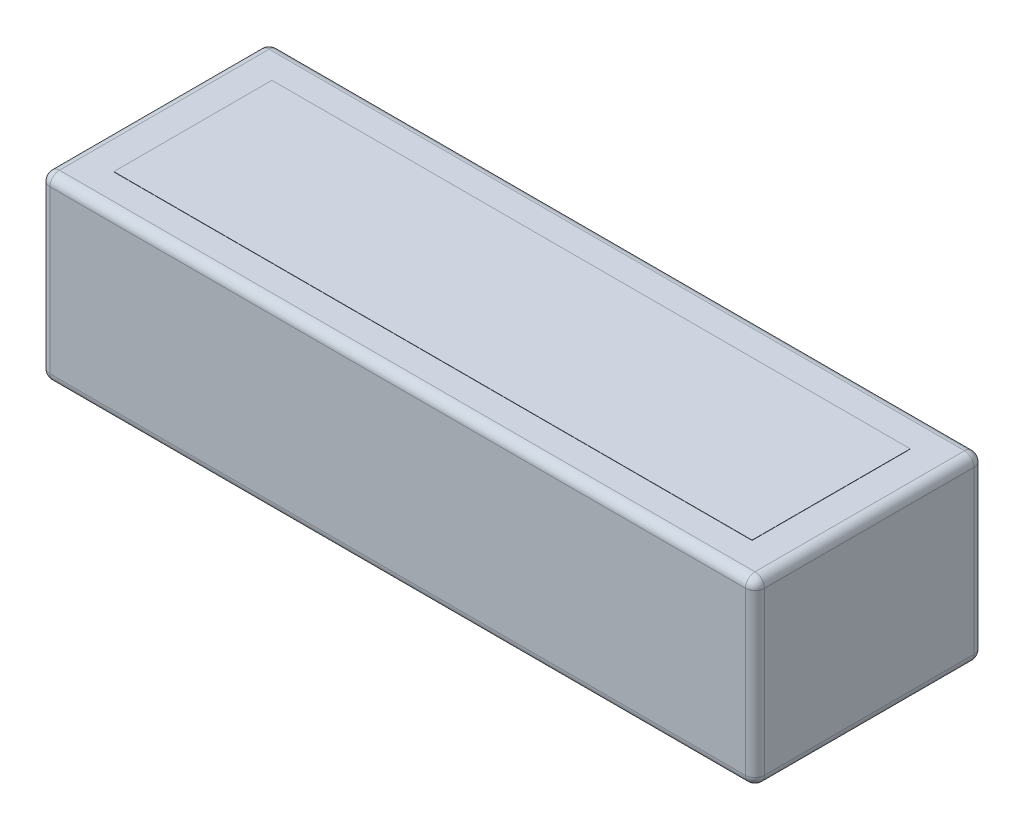
ISO-10303-21;
HEADER;
FILE_DESCRIPTION(('STEP AP214'),'2;1');
FILE_NAME('part.step','',(''),(''),'','','');
FILE_SCHEMA(('AUTOMOTIVE_DESIGN { 1 0 10303 214 1 1 1 1 }'));
ENDSEC;
DATA;
#1=APPLICATION_CONTEXT('core data for automotive mechanical design processes');
#2=APPLICATION_PROTOCOL_DEFINITION('international standard','automotive_design',2000,#1);
#3=PRODUCT_CONTEXT('',#1,'mechanical');
#4=PRODUCT('Part','Part','',(#3));
#5=PRODUCT_RELATED_PRODUCT_CATEGORY('part','',(#4));
#6=PRODUCT_DEFINITION_FORMATION('','',#4);
#7=PRODUCT_DEFINITION_CONTEXT('part definition',#1,'design');
#8=PRODUCT_DEFINITION('design','',#6,#7);
#9=PRODUCT_DEFINITION_SHAPE('','',#8);
#10=(LENGTH_UNIT() NAMED_UNIT(*) SI_UNIT(.MILLI.,.METRE.));
#11=(NAMED_UNIT(*) PLANE_ANGLE_UNIT() SI_UNIT($,.RADIAN.));
#12=(NAMED_UNIT(*) SI_UNIT($,.STERADIAN.) SOLID_ANGLE_UNIT());
#13=UNCERTAINTY_MEASURE_WITH_UNIT(LENGTH_MEASURE(1.E-05),#10,'distance_accuracy_value','');
#14=(GEOMETRIC_REPRESENTATION_CONTEXT(3) GLOBAL_UNCERTAINTY_ASSIGNED_CONTEXT((#13)) GLOBAL_UNIT_ASSIGNED_CONTEXT((#10,
#11,#12)) REPRESENTATION_CONTEXT('',''));
#15=CARTESIAN_POINT('',(0.,0.,0.));
#16=DIRECTION('',(0.,0.,1.));
#17=DIRECTION('',(1.,0.,0.));
#18=AXIS2_PLACEMENT_3D('',#15,#16,#17);
#19=CARTESIAN_POINT('',(0.,38.,0.));
#20=DIRECTION('',(0.,1.,0.));
#21=DIRECTION('',(0.,0.,1.));
#22=AXIS2_PLACEMENT_3D('',#19,#20,#21);
#23=PLANE('',#22);
#24=DIRECTION('',(1.,0.,0.));
#25=VECTOR('',#24,1.);
#26=CARTESIAN_POINT('',(73.,38.,22.));
#27=LINE('',#26,#25);
#28=CARTESIAN_POINT('',(-73.,38.,22.));
#29=VERTEX_POINT('',#28);
#30=CARTESIAN_POINT('',(73.,38.,22.));
#31=VERTEX_POINT('',#30);
#32=EDGE_CURVE('E243',#29,#31,#27,.T.);
#33=ORIENTED_EDGE('',*,*,#32,.T.);
#34=DIRECTION('',(0.,0.,-1.));
#35=VECTOR('',#34,1.);
#36=CARTESIAN_POINT('',(73.,38.,-22.));
#37=LINE('',#36,#35);
#38=CARTESIAN_POINT('',(73.,38.,-22.));
#39=VERTEX_POINT('',#38);
#40=EDGE_CURVE('E59',#31,#39,#37,.T.);
#41=ORIENTED_EDGE('',*,*,#40,.T.);
#42=DIRECTION('',(-1.,0.,0.));
#43=VECTOR('',#42,1.);
#44=CARTESIAN_POINT('',(-73.,38.,-22.));
#45=LINE('',#44,#43);
#46=CARTESIAN_POINT('',(-73.,38.,-22.));
#47=VERTEX_POINT('',#46);
#48=EDGE_CURVE('E245',#39,#47,#45,.T.);
#49=ORIENTED_EDGE('',*,*,#48,.T.);
#50=DIRECTION('',(0.,0.,1.));
#51=VECTOR('',#50,1.);
#52=CARTESIAN_POINT('',(-73.,38.,22.));
#53=LINE('',#52,#51);
#54=EDGE_CURVE('E241',#47,#29,#53,.T.);
#55=ORIENTED_EDGE('',*,*,#54,.T.);
#56=EDGE_LOOP('',(#33,#41,#49,#55));
#57=FACE_BOUND('',#56,.T.);
#58=DIRECTION('',(-1.,0.,0.));
#59=VECTOR('',#58,1.);
#60=CARTESIAN_POINT('',(-66.9958249658965,38.,-16.5987413872904));
#61=LINE('',#60,#59);
#62=CARTESIAN_POINT('',(66.9958249658965,38.,-16.5987413872904));
#63=VERTEX_POINT('',#62);
#64=CARTESIAN_POINT('',(-66.9958249658965,38.,-16.5987413872904));
#65=VERTEX_POINT('',#64);
#66=EDGE_CURVE('E561',#63,#65,#61,.T.);
#67=ORIENTED_EDGE('',*,*,#66,.F.);
#68=DIRECTION('',(0.,0.,-1.));
#69=VECTOR('',#68,1.);
#70=CARTESIAN_POINT('',(66.9958249658965,38.,-16.5987413872904));
#71=LINE('',#70,#69);
#72=CARTESIAN_POINT('',(66.9958249658965,38.,16.5987413872904));
#73=VERTEX_POINT('',#72);
#74=EDGE_CURVE('E172',#73,#63,#71,.T.);
#75=ORIENTED_EDGE('',*,*,#74,.F.);
#76=DIRECTION('',(1.,0.,0.));
#77=VECTOR('',#76,1.);
#78=CARTESIAN_POINT('',(-66.9958249658965,38.,16.5987413872904));
#79=LINE('',#78,#77);
#80=CARTESIAN_POINT('',(-66.9958249658965,38.,16.5987413872904));
#81=VERTEX_POINT('',#80);
#82=EDGE_CURVE('E168',#81,#73,#79,.T.);
#83=ORIENTED_EDGE('',*,*,#82,.F.);
#84=DIRECTION('',(0.,0.,1.));
#85=VECTOR('',#84,1.);
#86=CARTESIAN_POINT('',(-66.9958249658965,38.,-16.5987413872904));
#87=LINE('',#86,#85);
#88=EDGE_CURVE('E558',#65,#81,#87,.T.);
#89=ORIENTED_EDGE('',*,*,#88,.F.);
#90=EDGE_LOOP('',(#67,#75,#83,#89));
#91=FACE_BOUND('',#90,.T.);
#92=ADVANCED_FACE('F34',(#57,#91),#23,.T.);
#93=CARTESIAN_POINT('',(75.,38.,-24.));
#94=DIRECTION('',(-1.,0.,0.));
#95=DIRECTION('',(0.,0.,1.));
#96=AXIS2_PLACEMENT_3D('',#93,#94,#95);
#97=PLANE('',#96);
#98=DIRECTION('',(0.,-1.,0.));
#99=VECTOR('',#98,1.);
#100=CARTESIAN_POINT('',(75.,38.,-22.));
#101=LINE('',#100,#99);
#102=CARTESIAN_POINT('',(75.,2.,-22.));
#103=VERTEX_POINT('',#102);
#104=CARTESIAN_POINT('',(75.,36.,-22.));
#105=VERTEX_POINT('',#104);
#106=EDGE_CURVE('E191',#103,#105,#101,.F.);
#107=ORIENTED_EDGE('',*,*,#106,.T.);
#108=DIRECTION('',(0.,0.,-1.));
#109=VECTOR('',#108,1.);
#110=CARTESIAN_POINT('',(75.,36.,22.));
#111=LINE('',#110,#109);
#112=CARTESIAN_POINT('',(75.,36.,22.));
#113=VERTEX_POINT('',#112);
#114=EDGE_CURVE('E250',#105,#113,#111,.F.);
#115=ORIENTED_EDGE('',*,*,#114,.T.);
#116=DIRECTION('',(0.,-1.,0.));
#117=VECTOR('',#116,1.);
#118=CARTESIAN_POINT('',(75.,38.,22.));
#119=LINE('',#118,#117);
#120=CARTESIAN_POINT('',(75.,2.,22.));
#121=VERTEX_POINT('',#120);
#122=EDGE_CURVE('E188',#113,#121,#119,.T.);
#123=ORIENTED_EDGE('',*,*,#122,.T.);
#124=DIRECTION('',(0.,0.,-1.));
#125=VECTOR('',#124,1.);
#126=CARTESIAN_POINT('',(75.,2.,-24.));
#127=LINE('',#126,#125);
#128=EDGE_CURVE('E248',#121,#103,#127,.T.);
#129=ORIENTED_EDGE('',*,*,#128,.T.);
#130=EDGE_LOOP('',(#107,#115,#123,#129));
#131=FACE_BOUND('',#130,.T.);
#132=ADVANCED_FACE('F342',(#131),#97,.F.);
#133=CARTESIAN_POINT('',(-75.,38.,-24.));
#134=DIRECTION('',(0.,0.,1.));
#135=DIRECTION('',(1.,0.,0.));
#136=AXIS2_PLACEMENT_3D('',#133,#134,#135);
#137=PLANE('',#136);
#138=DIRECTION('',(0.,-1.,0.));
#139=VECTOR('',#138,1.);
#140=CARTESIAN_POINT('',(73.,38.,-24.));
#141=LINE('',#140,#139);
#142=CARTESIAN_POINT('',(73.,36.,-24.));
#143=VERTEX_POINT('',#142);
#144=CARTESIAN_POINT('',(73.,2.,-24.));
#145=VERTEX_POINT('',#144);
#146=EDGE_CURVE('E184',#143,#145,#141,.T.);
#147=ORIENTED_EDGE('',*,*,#146,.T.);
#148=DIRECTION('',(-1.,0.,0.));
#149=VECTOR('',#148,1.);
#150=CARTESIAN_POINT('',(-75.,2.,-24.));
#151=LINE('',#150,#149);
#152=CARTESIAN_POINT('',(-73.,2.,-24.));
#153=VERTEX_POINT('',#152);
#154=EDGE_CURVE('E214',#145,#153,#151,.T.);
#155=ORIENTED_EDGE('',*,*,#154,.T.);
#156=DIRECTION('',(0.,-1.,0.));
#157=VECTOR('',#156,1.);
#158=CARTESIAN_POINT('',(-73.,38.,-24.));
#159=LINE('',#158,#157);
#160=CARTESIAN_POINT('',(-73.,36.,-24.));
#161=VERTEX_POINT('',#160);
#162=EDGE_CURVE('E181',#153,#161,#159,.F.);
#163=ORIENTED_EDGE('',*,*,#162,.T.);
#164=DIRECTION('',(-1.,0.,0.));
#165=VECTOR('',#164,1.);
#166=CARTESIAN_POINT('',(73.,36.,-24.));
#167=LINE('',#166,#165);
#168=EDGE_CURVE('E212',#161,#143,#167,.F.);
#169=ORIENTED_EDGE('',*,*,#168,.T.);
#170=EDGE_LOOP('',(#147,#155,#163,#169));
#171=FACE_BOUND('',#170,.T.);
#172=ADVANCED_FACE('F393',(#171),#137,.F.);
#173=CARTESIAN_POINT('',(-75.,38.,-24.));
#174=DIRECTION('',(1.,0.,0.));
#175=DIRECTION('',(0.,0.,-1.));
#176=AXIS2_PLACEMENT_3D('',#173,#174,#175);
#177=PLANE('',#176);
#178=DIRECTION('',(0.,-1.,0.));
#179=VECTOR('',#178,1.);
#180=CARTESIAN_POINT('',(-75.,38.,-22.));
#181=LINE('',#180,#179);
#182=CARTESIAN_POINT('',(-75.,36.,-22.));
#183=VERTEX_POINT('',#182);
#184=CARTESIAN_POINT('',(-75.,2.,-22.));
#185=VERTEX_POINT('',#184);
#186=EDGE_CURVE('E203',#183,#185,#181,.T.);
#187=ORIENTED_EDGE('',*,*,#186,.T.);
#188=DIRECTION('',(0.,0.,1.));
#189=VECTOR('',#188,1.);
#190=CARTESIAN_POINT('',(-75.,2.,-24.));
#191=LINE('',#190,#189);
#192=CARTESIAN_POINT('',(-75.,2.,22.));
#193=VERTEX_POINT('',#192);
#194=EDGE_CURVE('E11',#185,#193,#191,.T.);
#195=ORIENTED_EDGE('',*,*,#194,.T.);
#196=DIRECTION('',(0.,-1.,0.));
#197=VECTOR('',#196,1.);
#198=CARTESIAN_POINT('',(-75.,38.,22.));
#199=LINE('',#198,#197);
#200=CARTESIAN_POINT('',(-75.,36.,22.));
#201=VERTEX_POINT('',#200);
#202=EDGE_CURVE('E200',#193,#201,#199,.F.);
#203=ORIENTED_EDGE('',*,*,#202,.T.);
#204=DIRECTION('',(0.,0.,1.));
#205=VECTOR('',#204,1.);
#206=CARTESIAN_POINT('',(-75.,36.,-22.));
#207=LINE('',#206,#205);
#208=EDGE_CURVE('E43',#201,#183,#207,.F.);
#209=ORIENTED_EDGE('',*,*,#208,.T.);
#210=EDGE_LOOP('',(#187,#195,#203,#209));
#211=FACE_BOUND('',#210,.T.);
#212=ADVANCED_FACE('F370',(#211),#177,.F.);
#213=CARTESIAN_POINT('',(-75.,38.,24.));
#214=DIRECTION('',(0.,0.,-1.));
#215=DIRECTION('',(-1.,0.,0.));
#216=AXIS2_PLACEMENT_3D('',#213,#214,#215);
#217=PLANE('',#216);
#218=DIRECTION('',(0.,-1.,0.));
#219=VECTOR('',#218,1.);
#220=CARTESIAN_POINT('',(-73.,38.,24.));
#221=LINE('',#220,#219);
#222=CARTESIAN_POINT('',(-73.,36.,24.));
#223=VERTEX_POINT('',#222);
#224=CARTESIAN_POINT('',(-73.,2.,24.));
#225=VERTEX_POINT('',#224);
#226=EDGE_CURVE('E194',#223,#225,#221,.T.);
#227=ORIENTED_EDGE('',*,*,#226,.T.);
#228=DIRECTION('',(1.,0.,0.));
#229=VECTOR('',#228,1.);
#230=CARTESIAN_POINT('',(-75.,2.,24.));
#231=LINE('',#230,#229);
#232=CARTESIAN_POINT('',(73.,2.,24.));
#233=VERTEX_POINT('',#232);
#234=EDGE_CURVE('E235',#225,#233,#231,.T.);
#235=ORIENTED_EDGE('',*,*,#234,.T.);
#236=DIRECTION('',(0.,-1.,0.));
#237=VECTOR('',#236,1.);
#238=CARTESIAN_POINT('',(73.,38.,24.));
#239=LINE('',#238,#237);
#240=CARTESIAN_POINT('',(73.,36.,24.));
#241=VERTEX_POINT('',#240);
#242=EDGE_CURVE('E197',#233,#241,#239,.F.);
#243=ORIENTED_EDGE('',*,*,#242,.T.);
#244=DIRECTION('',(1.,0.,0.));
#245=VECTOR('',#244,1.);
#246=CARTESIAN_POINT('',(-73.,36.,24.));
#247=LINE('',#246,#245);
#248=EDGE_CURVE('E233',#241,#223,#247,.F.);
#249=ORIENTED_EDGE('',*,*,#248,.T.);
#250=EDGE_LOOP('',(#227,#235,#243,#249));
#251=FACE_BOUND('',#250,.T.);
#252=ADVANCED_FACE('F305',(#251),#217,.F.);
#253=CARTESIAN_POINT('',(0.,0.,0.));
#254=DIRECTION('',(0.,1.,0.));
#255=DIRECTION('',(0.,0.,1.));
#256=AXIS2_PLACEMENT_3D('',#253,#254,#255);
#257=PLANE('',#256);
#258=DIRECTION('',(-1.,0.,0.));
#259=VECTOR('',#258,1.);
#260=CARTESIAN_POINT('',(0.,0.,-22.));
#261=LINE('',#260,#259);
#262=CARTESIAN_POINT('',(-73.,0.,-22.));
#263=VERTEX_POINT('',#262);
#264=CARTESIAN_POINT('',(73.,0.,-22.));
#265=VERTEX_POINT('',#264);
#266=EDGE_CURVE('E220',#263,#265,#261,.F.);
#267=ORIENTED_EDGE('',*,*,#266,.T.);
#268=DIRECTION('',(0.,0.,-1.));
#269=VECTOR('',#268,1.);
#270=CARTESIAN_POINT('',(73.,0.,0.));
#271=LINE('',#270,#269);
#272=CARTESIAN_POINT('',(73.,0.,22.));
#273=VERTEX_POINT('',#272);
#274=EDGE_CURVE('E223',#265,#273,#271,.F.);
#275=ORIENTED_EDGE('',*,*,#274,.T.);
#276=DIRECTION('',(1.,0.,0.));
#277=VECTOR('',#276,1.);
#278=CARTESIAN_POINT('',(0.,0.,22.));
#279=LINE('',#278,#277);
#280=CARTESIAN_POINT('',(-73.,0.,22.));
#281=VERTEX_POINT('',#280);
#282=EDGE_CURVE('E218',#273,#281,#279,.F.);
#283=ORIENTED_EDGE('',*,*,#282,.T.);
#284=DIRECTION('',(0.,0.,1.));
#285=VECTOR('',#284,1.);
#286=CARTESIAN_POINT('',(-73.,0.,0.));
#287=LINE('',#286,#285);
#288=EDGE_CURVE('E216',#281,#263,#287,.F.);
#289=ORIENTED_EDGE('',*,*,#288,.T.);
#290=EDGE_LOOP('',(#267,#275,#283,#289));
#291=FACE_BOUND('',#290,.T.);
#292=ADVANCED_FACE('F324',(#291),#257,.F.);
#293=CARTESIAN_POINT('',(73.,38.,-22.));
#294=DIRECTION('',(0.,-1.,0.));
#295=DIRECTION('',(0.,0.,-1.));
#296=AXIS2_PLACEMENT_3D('',#293,#294,#295);
#297=CYLINDRICAL_SURFACE('',#296,2.);
#298=ORIENTED_EDGE('',*,*,#106,.F.);
#299=CARTESIAN_POINT('',(73.,2.,-22.));
#300=DIRECTION('',(0.,-1.,0.));
#301=DIRECTION('',(0.,0.,-1.));
#302=AXIS2_PLACEMENT_3D('',#299,#300,#301);
#303=CIRCLE('',#302,2.);
#304=EDGE_CURVE('E227',#103,#145,#303,.F.);
#305=ORIENTED_EDGE('',*,*,#304,.T.);
#306=ORIENTED_EDGE('',*,*,#146,.F.);
#307=CARTESIAN_POINT('',(73.,36.,-22.));
#308=DIRECTION('',(0.,-1.,0.));
#309=DIRECTION('',(0.,0.,-1.));
#310=AXIS2_PLACEMENT_3D('',#307,#308,#309);
#311=CIRCLE('',#310,2.);
#312=EDGE_CURVE('E225',#143,#105,#311,.T.);
#313=ORIENTED_EDGE('',*,*,#312,.T.);
#314=EDGE_LOOP('',(#298,#305,#306,#313));
#315=FACE_BOUND('',#314,.T.);
#316=ADVANCED_FACE('F345',(#315),#297,.T.);
#317=CARTESIAN_POINT('',(73.,38.,22.));
#318=DIRECTION('',(0.,-1.,0.));
#319=DIRECTION('',(0.,0.,-1.));
#320=AXIS2_PLACEMENT_3D('',#317,#318,#319);
#321=CYLINDRICAL_SURFACE('',#320,2.);
#322=ORIENTED_EDGE('',*,*,#242,.F.);
#323=CARTESIAN_POINT('',(73.,2.,22.));
#324=DIRECTION('',(0.,-1.,0.));
#325=DIRECTION('',(0.,0.,-1.));
#326=AXIS2_PLACEMENT_3D('',#323,#324,#325);
#327=CIRCLE('',#326,2.);
#328=EDGE_CURVE('E231',#233,#121,#327,.F.);
#329=ORIENTED_EDGE('',*,*,#328,.T.);
#330=ORIENTED_EDGE('',*,*,#122,.F.);
#331=CARTESIAN_POINT('',(73.,36.,22.));
#332=DIRECTION('',(0.,-1.,0.));
#333=DIRECTION('',(0.,0.,-1.));
#334=AXIS2_PLACEMENT_3D('',#331,#332,#333);
#335=CIRCLE('',#334,2.);
#336=EDGE_CURVE('E229',#113,#241,#335,.T.);
#337=ORIENTED_EDGE('',*,*,#336,.T.);
#338=EDGE_LOOP('',(#322,#329,#330,#337));
#339=FACE_BOUND('',#338,.T.);
#340=ADVANCED_FACE('F302',(#339),#321,.T.);
#341=CARTESIAN_POINT('',(-73.,38.,-22.));
#342=DIRECTION('',(0.,-1.,0.));
#343=DIRECTION('',(0.,0.,-1.));
#344=AXIS2_PLACEMENT_3D('',#341,#342,#343);
#345=CYLINDRICAL_SURFACE('',#344,2.);
#346=ORIENTED_EDGE('',*,*,#162,.F.);
#347=CARTESIAN_POINT('',(-73.,2.,-22.));
#348=DIRECTION('',(0.,-1.,0.));
#349=DIRECTION('',(0.,0.,-1.));
#350=AXIS2_PLACEMENT_3D('',#347,#348,#349);
#351=CIRCLE('',#350,2.);
#352=EDGE_CURVE('E209',#153,#185,#351,.F.);
#353=ORIENTED_EDGE('',*,*,#352,.T.);
#354=ORIENTED_EDGE('',*,*,#186,.F.);
#355=CARTESIAN_POINT('',(-73.,36.,-22.));
#356=DIRECTION('',(0.,-1.,0.));
#357=DIRECTION('',(0.,0.,-1.));
#358=AXIS2_PLACEMENT_3D('',#355,#356,#357);
#359=CIRCLE('',#358,2.);
#360=EDGE_CURVE('E206',#183,#161,#359,.T.);
#361=ORIENTED_EDGE('',*,*,#360,.T.);
#362=EDGE_LOOP('',(#346,#353,#354,#361));
#363=FACE_BOUND('',#362,.T.);
#364=ADVANCED_FACE('F375',(#363),#345,.T.);
#365=CARTESIAN_POINT('',(-73.,38.,22.));
#366=DIRECTION('',(0.,-1.,0.));
#367=DIRECTION('',(0.,0.,-1.));
#368=AXIS2_PLACEMENT_3D('',#365,#366,#367);
#369=CYLINDRICAL_SURFACE('',#368,2.);
#370=ORIENTED_EDGE('',*,*,#202,.F.);
#371=CARTESIAN_POINT('',(-73.,2.,22.));
#372=DIRECTION('',(0.,-1.,0.));
#373=DIRECTION('',(0.,0.,-1.));
#374=AXIS2_PLACEMENT_3D('',#371,#372,#373);
#375=CIRCLE('',#374,2.);
#376=EDGE_CURVE('E239',#193,#225,#375,.F.);
#377=ORIENTED_EDGE('',*,*,#376,.T.);
#378=ORIENTED_EDGE('',*,*,#226,.F.);
#379=CARTESIAN_POINT('',(-73.,36.,22.));
#380=DIRECTION('',(0.,-1.,0.));
#381=DIRECTION('',(0.,0.,-1.));
#382=AXIS2_PLACEMENT_3D('',#379,#380,#381);
#383=CIRCLE('',#382,2.);
#384=EDGE_CURVE('E237',#223,#201,#383,.T.);
#385=ORIENTED_EDGE('',*,*,#384,.T.);
#386=EDGE_LOOP('',(#370,#377,#378,#385));
#387=FACE_BOUND('',#386,.T.);
#388=ADVANCED_FACE('F412',(#387),#369,.T.);
#389=CARTESIAN_POINT('',(73.,2.,22.));
#390=DIRECTION('',(0.,1.,0.));
#391=DIRECTION('',(0.,0.,1.));
#392=AXIS2_PLACEMENT_3D('',#389,#390,#391);
#393=SPHERICAL_SURFACE('',#392,2.);
#394=CARTESIAN_POINT('',(73.,2.,22.));
#395=DIRECTION('',(0.,0.,-1.));
#396=DIRECTION('',(-1.,0.,0.));
#397=AXIS2_PLACEMENT_3D('',#394,#395,#396);
#398=CIRCLE('',#397,2.);
#399=EDGE_CURVE('E269',#121,#273,#398,.T.);
#400=ORIENTED_EDGE('',*,*,#399,.F.);
#401=ORIENTED_EDGE('',*,*,#328,.F.);
#402=CARTESIAN_POINT('',(73.,2.,22.));
#403=DIRECTION('',(-1.,0.,0.));
#404=DIRECTION('',(0.,0.,1.));
#405=AXIS2_PLACEMENT_3D('',#402,#403,#404);
#406=CIRCLE('',#405,2.);
#407=EDGE_CURVE('E185',#273,#233,#406,.T.);
#408=ORIENTED_EDGE('',*,*,#407,.F.);
#409=EDGE_LOOP('',(#400,#401,#408));
#410=FACE_BOUND('',#409,.T.);
#411=ADVANCED_FACE('F340',(#410),#393,.T.);
#412=CARTESIAN_POINT('',(-75.,2.,22.));
#413=DIRECTION('',(1.,0.,0.));
#414=DIRECTION('',(0.,0.,-1.));
#415=AXIS2_PLACEMENT_3D('',#412,#413,#414);
#416=CYLINDRICAL_SURFACE('',#415,2.);
#417=ORIENTED_EDGE('',*,*,#407,.T.);
#418=ORIENTED_EDGE('',*,*,#234,.F.);
#419=CARTESIAN_POINT('',(-73.,2.,22.));
#420=DIRECTION('',(-1.,0.,0.));
#421=DIRECTION('',(0.,0.,1.));
#422=AXIS2_PLACEMENT_3D('',#419,#420,#421);
#423=CIRCLE('',#422,2.);
#424=EDGE_CURVE('E266',#281,#225,#423,.T.);
#425=ORIENTED_EDGE('',*,*,#424,.F.);
#426=ORIENTED_EDGE('',*,*,#282,.F.);
#427=EDGE_LOOP('',(#417,#418,#425,#426));
#428=FACE_BOUND('',#427,.T.);
#429=ADVANCED_FACE('F310',(#428),#416,.T.);
#430=CARTESIAN_POINT('',(73.,2.,-24.));
#431=DIRECTION('',(0.,0.,-1.));
#432=DIRECTION('',(-1.,0.,0.));
#433=AXIS2_PLACEMENT_3D('',#430,#431,#432);
#434=CYLINDRICAL_SURFACE('',#433,2.);
#435=ORIENTED_EDGE('',*,*,#399,.T.);
#436=ORIENTED_EDGE('',*,*,#274,.F.);
#437=CARTESIAN_POINT('',(73.,2.,-22.));
#438=DIRECTION('',(0.,0.,-1.));
#439=DIRECTION('',(-1.,0.,0.));
#440=AXIS2_PLACEMENT_3D('',#437,#438,#439);
#441=CIRCLE('',#440,2.);
#442=EDGE_CURVE('E263',#103,#265,#441,.T.);
#443=ORIENTED_EDGE('',*,*,#442,.F.);
#444=ORIENTED_EDGE('',*,*,#128,.F.);
#445=EDGE_LOOP('',(#435,#436,#443,#444));
#446=FACE_BOUND('',#445,.T.);
#447=ADVANCED_FACE('F337',(#446),#434,.T.);
#448=CARTESIAN_POINT('',(-73.,2.,22.));
#449=DIRECTION('',(0.,1.,0.));
#450=DIRECTION('',(0.,0.,1.));
#451=AXIS2_PLACEMENT_3D('',#448,#449,#450);
#452=SPHERICAL_SURFACE('',#451,2.);
#453=ORIENTED_EDGE('',*,*,#424,.T.);
#454=ORIENTED_EDGE('',*,*,#376,.F.);
#455=CARTESIAN_POINT('',(-73.,2.,22.));
#456=DIRECTION('',(0.,0.,-1.));
#457=DIRECTION('',(-1.,0.,0.));
#458=AXIS2_PLACEMENT_3D('',#455,#456,#457);
#459=CIRCLE('',#458,2.);
#460=EDGE_CURVE('E260',#281,#193,#459,.T.);
#461=ORIENTED_EDGE('',*,*,#460,.F.);
#462=EDGE_LOOP('',(#453,#454,#461));
#463=FACE_BOUND('',#462,.T.);
#464=ADVANCED_FACE('F316',(#463),#452,.T.);
#465=CARTESIAN_POINT('',(73.,2.,-22.));
#466=DIRECTION('',(0.,1.,0.));
#467=DIRECTION('',(0.,0.,1.));
#468=AXIS2_PLACEMENT_3D('',#465,#466,#467);
#469=SPHERICAL_SURFACE('',#468,2.);
#470=ORIENTED_EDGE('',*,*,#304,.F.);
#471=ORIENTED_EDGE('',*,*,#442,.T.);
#472=CARTESIAN_POINT('',(73.,2.,-22.));
#473=DIRECTION('',(-1.,0.,0.));
#474=DIRECTION('',(0.,0.,1.));
#475=AXIS2_PLACEMENT_3D('',#472,#473,#474);
#476=CIRCLE('',#475,2.);
#477=EDGE_CURVE('E258',#145,#265,#476,.T.);
#478=ORIENTED_EDGE('',*,*,#477,.F.);
#479=EDGE_LOOP('',(#470,#471,#478));
#480=FACE_BOUND('',#479,.T.);
#481=ADVANCED_FACE('F334',(#480),#469,.T.);
#482=CARTESIAN_POINT('',(-73.,2.,-24.));
#483=DIRECTION('',(0.,0.,1.));
#484=DIRECTION('',(1.,0.,0.));
#485=AXIS2_PLACEMENT_3D('',#482,#483,#484);
#486=CYLINDRICAL_SURFACE('',#485,2.);
#487=ORIENTED_EDGE('',*,*,#460,.T.);
#488=ORIENTED_EDGE('',*,*,#194,.F.);
#489=CARTESIAN_POINT('',(-73.,2.,-22.));
#490=DIRECTION('',(0.,0.,-1.));
#491=DIRECTION('',(-1.,0.,0.));
#492=AXIS2_PLACEMENT_3D('',#489,#490,#491);
#493=CIRCLE('',#492,2.);
#494=EDGE_CURVE('E256',#263,#185,#493,.T.);
#495=ORIENTED_EDGE('',*,*,#494,.F.);
#496=ORIENTED_EDGE('',*,*,#288,.F.);
#497=EDGE_LOOP('',(#487,#488,#495,#496));
#498=FACE_BOUND('',#497,.T.);
#499=ADVANCED_FACE('F321',(#498),#486,.T.);
#500=CARTESIAN_POINT('',(-75.,2.,-22.));
#501=DIRECTION('',(-1.,0.,0.));
#502=DIRECTION('',(0.,0.,1.));
#503=AXIS2_PLACEMENT_3D('',#500,#501,#502);
#504=CYLINDRICAL_SURFACE('',#503,2.);
#505=ORIENTED_EDGE('',*,*,#477,.T.);
#506=ORIENTED_EDGE('',*,*,#266,.F.);
#507=CARTESIAN_POINT('',(-73.,2.,-22.));
#508=DIRECTION('',(-1.,0.,0.));
#509=DIRECTION('',(0.,0.,1.));
#510=AXIS2_PLACEMENT_3D('',#507,#508,#509);
#511=CIRCLE('',#510,2.);
#512=EDGE_CURVE('E253',#153,#263,#511,.T.);
#513=ORIENTED_EDGE('',*,*,#512,.F.);
#514=ORIENTED_EDGE('',*,*,#154,.F.);
#515=EDGE_LOOP('',(#505,#506,#513,#514));
#516=FACE_BOUND('',#515,.T.);
#517=ADVANCED_FACE('F327',(#516),#504,.T.);
#518=CARTESIAN_POINT('',(-73.,2.,-22.));
#519=DIRECTION('',(0.,1.,0.));
#520=DIRECTION('',(0.,0.,1.));
#521=AXIS2_PLACEMENT_3D('',#518,#519,#520);
#522=SPHERICAL_SURFACE('',#521,2.);
#523=ORIENTED_EDGE('',*,*,#494,.T.);
#524=ORIENTED_EDGE('',*,*,#352,.F.);
#525=ORIENTED_EDGE('',*,*,#512,.T.);
#526=EDGE_LOOP('',(#523,#524,#525));
#527=FACE_BOUND('',#526,.T.);
#528=ADVANCED_FACE('F416',(#527),#522,.T.);
#529=CARTESIAN_POINT('',(73.,36.,22.));
#530=DIRECTION('',(0.,1.,0.));
#531=DIRECTION('',(0.,0.,1.));
#532=AXIS2_PLACEMENT_3D('',#529,#530,#531);
#533=SPHERICAL_SURFACE('',#532,2.);
#534=CARTESIAN_POINT('',(73.,36.,22.));
#535=DIRECTION('',(-1.,0.,0.));
#536=DIRECTION('',(0.,0.,1.));
#537=AXIS2_PLACEMENT_3D('',#534,#535,#536);
#538=CIRCLE('',#537,2.);
#539=EDGE_CURVE('E286',#241,#31,#538,.T.);
#540=ORIENTED_EDGE('',*,*,#539,.F.);
#541=ORIENTED_EDGE('',*,*,#336,.F.);
#542=CARTESIAN_POINT('',(73.,36.,22.));
#543=DIRECTION('',(0.,0.,-1.));
#544=DIRECTION('',(-1.,0.,0.));
#545=AXIS2_PLACEMENT_3D('',#542,#543,#544);
#546=CIRCLE('',#545,2.);
#547=EDGE_CURVE('E38',#31,#113,#546,.T.);
#548=ORIENTED_EDGE('',*,*,#547,.F.);
#549=EDGE_LOOP('',(#540,#541,#548));
#550=FACE_BOUND('',#549,.T.);
#551=ADVANCED_FACE('F36',(#550),#533,.T.);
#552=CARTESIAN_POINT('',(73.,36.,0.));
#553=DIRECTION('',(0.,0.,1.));
#554=DIRECTION('',(1.,0.,0.));
#555=AXIS2_PLACEMENT_3D('',#552,#553,#554);
#556=CYLINDRICAL_SURFACE('',#555,2.);
#557=ORIENTED_EDGE('',*,*,#547,.T.);
#558=ORIENTED_EDGE('',*,*,#114,.F.);
#559=CARTESIAN_POINT('',(73.,36.,-22.));
#560=DIRECTION('',(0.,0.,-1.));
#561=DIRECTION('',(-1.,0.,0.));
#562=AXIS2_PLACEMENT_3D('',#559,#560,#561);
#563=CIRCLE('',#562,2.);
#564=EDGE_CURVE('E284',#39,#105,#563,.T.);
#565=ORIENTED_EDGE('',*,*,#564,.F.);
#566=ORIENTED_EDGE('',*,*,#40,.F.);
#567=EDGE_LOOP('',(#557,#558,#565,#566));
#568=FACE_BOUND('',#567,.T.);
#569=ADVANCED_FACE('F296',(#568),#556,.T.);
#570=CARTESIAN_POINT('',(0.,36.,22.));
#571=DIRECTION('',(-1.,0.,0.));
#572=DIRECTION('',(0.,0.,1.));
#573=AXIS2_PLACEMENT_3D('',#570,#571,#572);
#574=CYLINDRICAL_SURFACE('',#573,2.);
#575=ORIENTED_EDGE('',*,*,#539,.T.);
#576=ORIENTED_EDGE('',*,*,#32,.F.);
#577=CARTESIAN_POINT('',(-73.,36.,22.));
#578=DIRECTION('',(-1.,0.,0.));
#579=DIRECTION('',(0.,0.,1.));
#580=AXIS2_PLACEMENT_3D('',#577,#578,#579);
#581=CIRCLE('',#580,2.);
#582=EDGE_CURVE('E281',#223,#29,#581,.T.);
#583=ORIENTED_EDGE('',*,*,#582,.F.);
#584=ORIENTED_EDGE('',*,*,#248,.F.);
#585=EDGE_LOOP('',(#575,#576,#583,#584));
#586=FACE_BOUND('',#585,.T.);
#587=ADVANCED_FACE('F361',(#586),#574,.T.);
#588=CARTESIAN_POINT('',(73.,36.,-22.));
#589=DIRECTION('',(0.,1.,0.));
#590=DIRECTION('',(0.,0.,1.));
#591=AXIS2_PLACEMENT_3D('',#588,#589,#590);
#592=SPHERICAL_SURFACE('',#591,2.);
#593=ORIENTED_EDGE('',*,*,#564,.T.);
#594=ORIENTED_EDGE('',*,*,#312,.F.);
#595=CARTESIAN_POINT('',(73.,36.,-22.));
#596=DIRECTION('',(-1.,0.,0.));
#597=DIRECTION('',(0.,0.,1.));
#598=AXIS2_PLACEMENT_3D('',#595,#596,#597);
#599=CIRCLE('',#598,2.);
#600=EDGE_CURVE('E278',#39,#143,#599,.T.);
#601=ORIENTED_EDGE('',*,*,#600,.F.);
#602=EDGE_LOOP('',(#593,#594,#601));
#603=FACE_BOUND('',#602,.T.);
#604=ADVANCED_FACE('F350',(#603),#592,.T.);
#605=CARTESIAN_POINT('',(-73.,36.,22.));
#606=DIRECTION('',(0.,1.,0.));
#607=DIRECTION('',(0.,0.,1.));
#608=AXIS2_PLACEMENT_3D('',#605,#606,#607);
#609=SPHERICAL_SURFACE('',#608,2.);
#610=ORIENTED_EDGE('',*,*,#384,.F.);
#611=ORIENTED_EDGE('',*,*,#582,.T.);
#612=CARTESIAN_POINT('',(-73.,36.,22.));
#613=DIRECTION('',(0.,0.,-1.));
#614=DIRECTION('',(-1.,0.,0.));
#615=AXIS2_PLACEMENT_3D('',#612,#613,#614);
#616=CIRCLE('',#615,2.);
#617=EDGE_CURVE('E275',#201,#29,#616,.T.);
#618=ORIENTED_EDGE('',*,*,#617,.F.);
#619=EDGE_LOOP('',(#610,#611,#618));
#620=FACE_BOUND('',#619,.T.);
#621=ADVANCED_FACE('F365',(#620),#609,.T.);
#622=CARTESIAN_POINT('',(0.,36.,-22.));
#623=DIRECTION('',(1.,0.,0.));
#624=DIRECTION('',(0.,0.,-1.));
#625=AXIS2_PLACEMENT_3D('',#622,#623,#624);
#626=CYLINDRICAL_SURFACE('',#625,2.);
#627=ORIENTED_EDGE('',*,*,#600,.T.);
#628=ORIENTED_EDGE('',*,*,#168,.F.);
#629=CARTESIAN_POINT('',(-73.,36.,-22.));
#630=DIRECTION('',(-1.,0.,0.));
#631=DIRECTION('',(0.,0.,1.));
#632=AXIS2_PLACEMENT_3D('',#629,#630,#631);
#633=CIRCLE('',#632,2.);
#634=EDGE_CURVE('E176',#47,#161,#633,.T.);
#635=ORIENTED_EDGE('',*,*,#634,.F.);
#636=ORIENTED_EDGE('',*,*,#48,.F.);
#637=EDGE_LOOP('',(#627,#628,#635,#636));
#638=FACE_BOUND('',#637,.T.);
#639=ADVANCED_FACE('F354',(#638),#626,.T.);
#640=CARTESIAN_POINT('',(-73.,36.,0.));
#641=DIRECTION('',(0.,0.,-1.));
#642=DIRECTION('',(-1.,0.,0.));
#643=AXIS2_PLACEMENT_3D('',#640,#641,#642);
#644=CYLINDRICAL_SURFACE('',#643,2.);
#645=ORIENTED_EDGE('',*,*,#617,.T.);
#646=ORIENTED_EDGE('',*,*,#54,.F.);
#647=CARTESIAN_POINT('',(-73.,36.,-22.));
#648=DIRECTION('',(0.,0.,-1.));
#649=DIRECTION('',(-1.,0.,0.));
#650=AXIS2_PLACEMENT_3D('',#647,#648,#649);
#651=CIRCLE('',#650,2.);
#652=EDGE_CURVE('E174',#183,#47,#651,.T.);
#653=ORIENTED_EDGE('',*,*,#652,.F.);
#654=ORIENTED_EDGE('',*,*,#208,.F.);
#655=EDGE_LOOP('',(#645,#646,#653,#654));
#656=FACE_BOUND('',#655,.T.);
#657=ADVANCED_FACE('F367',(#656),#644,.T.);
#658=CARTESIAN_POINT('',(-73.,36.,-22.));
#659=DIRECTION('',(0.,1.,0.));
#660=DIRECTION('',(0.,0.,1.));
#661=AXIS2_PLACEMENT_3D('',#658,#659,#660);
#662=SPHERICAL_SURFACE('',#661,2.);
#663=ORIENTED_EDGE('',*,*,#634,.T.);
#664=ORIENTED_EDGE('',*,*,#360,.F.);
#665=ORIENTED_EDGE('',*,*,#652,.T.);
#666=EDGE_LOOP('',(#663,#664,#665));
#667=FACE_BOUND('',#666,.T.);
#668=ADVANCED_FACE('F378',(#667),#662,.T.);
#669=CARTESIAN_POINT('',(66.9958249658965,38.05,-16.5987413872904));
#670=DIRECTION('',(-1.,0.,0.));
#671=DIRECTION('',(0.,0.,1.));
#672=AXIS2_PLACEMENT_3D('',#669,#670,#671);
#673=PLANE('',#672);
#674=ORIENTED_EDGE('',*,*,#74,.T.);
#675=DIRECTION('',(0.,-1.,0.));
#676=VECTOR('',#675,1.);
#677=CARTESIAN_POINT('',(66.9958249658965,38.05,-16.5987413872904));
#678=LINE('',#677,#676);
#679=CARTESIAN_POINT('',(66.9958249658965,38.05,-16.5987413872904));
#680=VERTEX_POINT('',#679);
#681=EDGE_CURVE('E153',#680,#63,#678,.T.);
#682=ORIENTED_EDGE('',*,*,#681,.F.);
#683=DIRECTION('',(0.,0.,-1.));
#684=VECTOR('',#683,1.);
#685=CARTESIAN_POINT('',(66.9958249658965,38.05,-16.5987413872904));
#686=LINE('',#685,#684);
#687=CARTESIAN_POINT('',(66.9958249658965,38.05,16.5987413872904));
#688=VERTEX_POINT('',#687);
#689=EDGE_CURVE('E160',#688,#680,#686,.T.);
#690=ORIENTED_EDGE('',*,*,#689,.F.);
#691=DIRECTION('',(0.,-1.,0.));
#692=VECTOR('',#691,1.);
#693=CARTESIAN_POINT('',(66.9958249658965,38.05,16.5987413872904));
#694=LINE('',#693,#692);
#695=EDGE_CURVE('E556',#688,#73,#694,.T.);
#696=ORIENTED_EDGE('',*,*,#695,.T.);
#697=EDGE_LOOP('',(#674,#682,#690,#696));
#698=FACE_BOUND('',#697,.T.);
#699=ADVANCED_FACE('F170',(#698),#673,.F.);
#700=CARTESIAN_POINT('',(-66.9958249658965,38.05,-16.5987413872904));
#701=DIRECTION('',(0.,0.,1.));
#702=DIRECTION('',(1.,0.,0.));
#703=AXIS2_PLACEMENT_3D('',#700,#701,#702);
#704=PLANE('',#703);
#705=ORIENTED_EDGE('',*,*,#66,.T.);
#706=DIRECTION('',(0.,-1.,0.));
#707=VECTOR('',#706,1.);
#708=CARTESIAN_POINT('',(-66.9958249658965,38.05,-16.5987413872904));
#709=LINE('',#708,#707);
#710=CARTESIAN_POINT('',(-66.9958249658965,38.05,-16.5987413872904));
#711=VERTEX_POINT('',#710);
#712=EDGE_CURVE('E156',#711,#65,#709,.T.);
#713=ORIENTED_EDGE('',*,*,#712,.F.);
#714=DIRECTION('',(-1.,0.,0.));
#715=VECTOR('',#714,1.);
#716=CARTESIAN_POINT('',(-66.9958249658965,38.05,-16.5987413872904));
#717=LINE('',#716,#715);
#718=EDGE_CURVE('E149',#680,#711,#717,.T.);
#719=ORIENTED_EDGE('',*,*,#718,.F.);
#720=ORIENTED_EDGE('',*,*,#681,.T.);
#721=EDGE_LOOP('',(#705,#713,#719,#720));
#722=FACE_BOUND('',#721,.T.);
#723=ADVANCED_FACE('F151',(#722),#704,.F.);
#724=CARTESIAN_POINT('',(-66.9958249658965,38.05,-16.5987413872904));
#725=DIRECTION('',(1.,0.,0.));
#726=DIRECTION('',(0.,0.,-1.));
#727=AXIS2_PLACEMENT_3D('',#724,#725,#726);
#728=PLANE('',#727);
#729=ORIENTED_EDGE('',*,*,#88,.T.);
#730=DIRECTION('',(0.,-1.,0.));
#731=VECTOR('',#730,1.);
#732=CARTESIAN_POINT('',(-66.9958249658965,38.05,16.5987413872904));
#733=LINE('',#732,#731);
#734=CARTESIAN_POINT('',(-66.9958249658965,38.05,16.5987413872904));
#735=VERTEX_POINT('',#734);
#736=EDGE_CURVE('E51',#735,#81,#733,.T.);
#737=ORIENTED_EDGE('',*,*,#736,.F.);
#738=DIRECTION('',(0.,0.,1.));
#739=VECTOR('',#738,1.);
#740=CARTESIAN_POINT('',(-66.9958249658965,38.05,-16.5987413872904));
#741=LINE('',#740,#739);
#742=EDGE_CURVE('E159',#711,#735,#741,.T.);
#743=ORIENTED_EDGE('',*,*,#742,.F.);
#744=ORIENTED_EDGE('',*,*,#712,.T.);
#745=EDGE_LOOP('',(#729,#737,#743,#744));
#746=FACE_BOUND('',#745,.T.);
#747=ADVANCED_FACE('F526',(#746),#728,.F.);
#748=CARTESIAN_POINT('',(-66.9958249658965,38.05,16.5987413872904));
#749=DIRECTION('',(0.,0.,-1.));
#750=DIRECTION('',(-1.,0.,0.));
#751=AXIS2_PLACEMENT_3D('',#748,#749,#750);
#752=PLANE('',#751);
#753=ORIENTED_EDGE('',*,*,#82,.T.);
#754=ORIENTED_EDGE('',*,*,#695,.F.);
#755=DIRECTION('',(1.,0.,0.));
#756=VECTOR('',#755,1.);
#757=CARTESIAN_POINT('',(-66.9958249658965,38.05,16.5987413872904));
#758=LINE('',#757,#756);
#759=EDGE_CURVE('E164',#735,#688,#758,.T.);
#760=ORIENTED_EDGE('',*,*,#759,.F.);
#761=ORIENTED_EDGE('',*,*,#736,.T.);
#762=EDGE_LOOP('',(#753,#754,#760,#761));
#763=FACE_BOUND('',#762,.T.);
#764=ADVANCED_FACE('F534',(#763),#752,.F.);
#765=CARTESIAN_POINT('',(0.,38.05,0.));
#766=DIRECTION('',(0.,1.,0.));
#767=DIRECTION('',(0.,0.,1.));
#768=AXIS2_PLACEMENT_3D('',#765,#766,#767);
#769=PLANE('',#768);
#770=ORIENTED_EDGE('',*,*,#689,.T.);
#771=ORIENTED_EDGE('',*,*,#718,.T.);
#772=ORIENTED_EDGE('',*,*,#742,.T.);
#773=ORIENTED_EDGE('',*,*,#759,.T.);
#774=EDGE_LOOP('',(#770,#771,#772,#773));
#775=FACE_BOUND('',#774,.T.);
#776=ADVANCED_FACE('F163',(#775),#769,.T.);
#777=CLOSED_SHELL('',(#92,#132,#172,#212,#252,#292,#316,#340,#364,#388,#411,#429,#447,#464,#481,
#499,#517,#528,#551,#569,#587,#604,#621,#639,#657,#668,#699,#723,#747,#764,#776));
#778=MANIFOLD_SOLID_BREP('B2',#777);
#779=ADVANCED_BREP_SHAPE_REPRESENTATION('',(#18,#778),#14);
#780=SHAPE_DEFINITION_REPRESENTATION(#9,#779);
ENDSEC;
END-ISO-10303-21;
